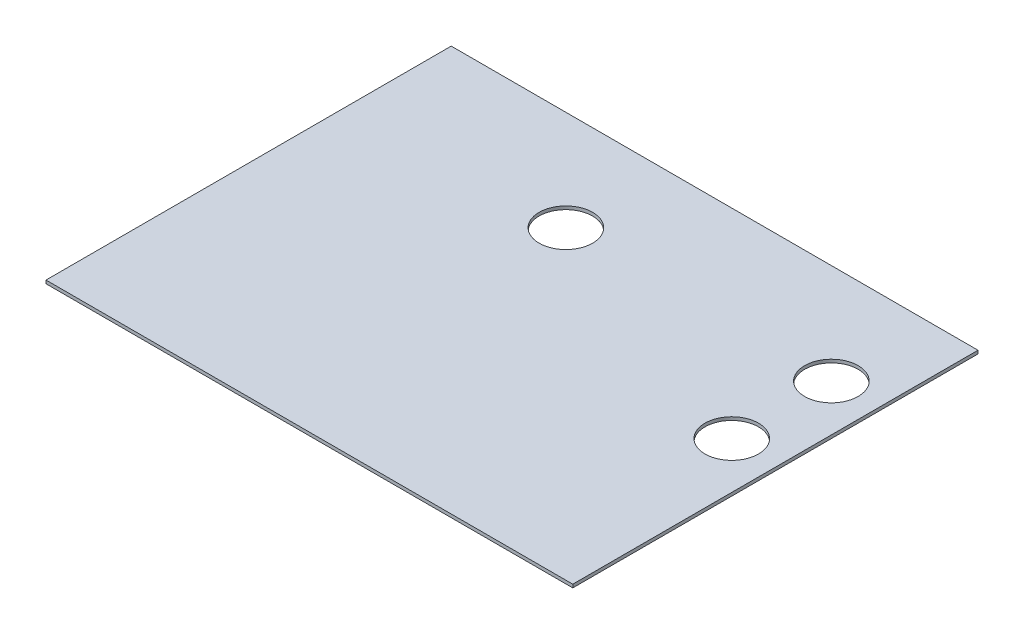
ISO-10303-21;
HEADER;
FILE_DESCRIPTION(('STEP AP214'),'2;1');
FILE_NAME('part.step','',(''),(''),'','','');
FILE_SCHEMA(('AUTOMOTIVE_DESIGN { 1 0 10303 214 1 1 1 1 }'));
ENDSEC;
DATA;
#1=APPLICATION_CONTEXT('core data for automotive mechanical design processes');
#2=APPLICATION_PROTOCOL_DEFINITION('international standard','automotive_design',2000,#1);
#3=PRODUCT_CONTEXT('',#1,'mechanical');
#4=PRODUCT('Part','Part','',(#3));
#5=PRODUCT_RELATED_PRODUCT_CATEGORY('part','',(#4));
#6=PRODUCT_DEFINITION_FORMATION('','',#4);
#7=PRODUCT_DEFINITION_CONTEXT('part definition',#1,'design');
#8=PRODUCT_DEFINITION('design','',#6,#7);
#9=PRODUCT_DEFINITION_SHAPE('','',#8);
#10=(LENGTH_UNIT() NAMED_UNIT(*) SI_UNIT(.MILLI.,.METRE.));
#11=(NAMED_UNIT(*) PLANE_ANGLE_UNIT() SI_UNIT($,.RADIAN.));
#12=(NAMED_UNIT(*) SI_UNIT($,.STERADIAN.) SOLID_ANGLE_UNIT());
#13=UNCERTAINTY_MEASURE_WITH_UNIT(LENGTH_MEASURE(1.E-05),#10,'distance_accuracy_value','');
#14=(GEOMETRIC_REPRESENTATION_CONTEXT(3) GLOBAL_UNCERTAINTY_ASSIGNED_CONTEXT((#13)) GLOBAL_UNIT_ASSIGNED_CONTEXT((#10,
#11,#12)) REPRESENTATION_CONTEXT('',''));
#15=CARTESIAN_POINT('',(0.,0.,0.));
#16=DIRECTION('',(0.,0.,1.));
#17=DIRECTION('',(1.,0.,0.));
#18=AXIS2_PLACEMENT_3D('',#15,#16,#17);
#19=CARTESIAN_POINT('',(162.5,2.,-125.));
#20=DIRECTION('',(-1.,0.,0.));
#21=DIRECTION('',(0.,0.,1.));
#22=AXIS2_PLACEMENT_3D('',#19,#20,#21);
#23=PLANE('',#22);
#24=DIRECTION('',(0.,0.,-1.));
#25=VECTOR('',#24,1.);
#26=CARTESIAN_POINT('',(162.5,0.,-125.));
#27=LINE('',#26,#25);
#28=CARTESIAN_POINT('',(162.5,0.,125.));
#29=VERTEX_POINT('',#28);
#30=CARTESIAN_POINT('',(162.5,0.,-125.));
#31=VERTEX_POINT('',#30);
#32=EDGE_CURVE('E101',#29,#31,#27,.T.);
#33=ORIENTED_EDGE('',*,*,#32,.T.);
#34=DIRECTION('',(0.,-1.,0.));
#35=VECTOR('',#34,1.);
#36=CARTESIAN_POINT('',(162.5,2.,-125.));
#37=LINE('',#36,#35);
#38=CARTESIAN_POINT('',(162.5,2.,-125.));
#39=VERTEX_POINT('',#38);
#40=EDGE_CURVE('E11',#39,#31,#37,.T.);
#41=ORIENTED_EDGE('',*,*,#40,.F.);
#42=DIRECTION('',(0.,0.,-1.));
#43=VECTOR('',#42,1.);
#44=CARTESIAN_POINT('',(162.5,2.,-125.));
#45=LINE('',#44,#43);
#46=CARTESIAN_POINT('',(162.5,2.,125.));
#47=VERTEX_POINT('',#46);
#48=EDGE_CURVE('E89',#47,#39,#45,.T.);
#49=ORIENTED_EDGE('',*,*,#48,.F.);
#50=DIRECTION('',(0.,-1.,0.));
#51=VECTOR('',#50,1.);
#52=CARTESIAN_POINT('',(162.5,2.,125.));
#53=LINE('',#52,#51);
#54=EDGE_CURVE('E97',#47,#29,#53,.T.);
#55=ORIENTED_EDGE('',*,*,#54,.T.);
#56=EDGE_LOOP('',(#33,#41,#49,#55));
#57=FACE_BOUND('',#56,.T.);
#58=ADVANCED_FACE('F38',(#57),#23,.F.);
#59=CARTESIAN_POINT('',(-162.5,2.,-125.));
#60=DIRECTION('',(0.,0.,1.));
#61=DIRECTION('',(1.,0.,0.));
#62=AXIS2_PLACEMENT_3D('',#59,#60,#61);
#63=PLANE('',#62);
#64=DIRECTION('',(-1.,0.,0.));
#65=VECTOR('',#64,1.);
#66=CARTESIAN_POINT('',(-162.5,0.,-125.));
#67=LINE('',#66,#65);
#68=CARTESIAN_POINT('',(-162.5,0.,-125.));
#69=VERTEX_POINT('',#68);
#70=EDGE_CURVE('E93',#31,#69,#67,.T.);
#71=ORIENTED_EDGE('',*,*,#70,.T.);
#72=DIRECTION('',(0.,-1.,0.));
#73=VECTOR('',#72,1.);
#74=CARTESIAN_POINT('',(-162.5,2.,-125.));
#75=LINE('',#74,#73);
#76=CARTESIAN_POINT('',(-162.5,2.,-125.));
#77=VERTEX_POINT('',#76);
#78=EDGE_CURVE('E46',#77,#69,#75,.T.);
#79=ORIENTED_EDGE('',*,*,#78,.F.);
#80=DIRECTION('',(-1.,0.,0.));
#81=VECTOR('',#80,1.);
#82=CARTESIAN_POINT('',(-162.5,2.,-125.));
#83=LINE('',#82,#81);
#84=EDGE_CURVE('E84',#39,#77,#83,.T.);
#85=ORIENTED_EDGE('',*,*,#84,.F.);
#86=ORIENTED_EDGE('',*,*,#40,.T.);
#87=EDGE_LOOP('',(#71,#79,#85,#86));
#88=FACE_BOUND('',#87,.T.);
#89=ADVANCED_FACE('F92',(#88),#63,.F.);
#90=CARTESIAN_POINT('',(-162.5,2.,-125.));
#91=DIRECTION('',(1.,0.,0.));
#92=DIRECTION('',(0.,0.,-1.));
#93=AXIS2_PLACEMENT_3D('',#90,#91,#92);
#94=PLANE('',#93);
#95=DIRECTION('',(0.,0.,1.));
#96=VECTOR('',#95,1.);
#97=CARTESIAN_POINT('',(-162.5,0.,-125.));
#98=LINE('',#97,#96);
#99=CARTESIAN_POINT('',(-162.5,0.,125.));
#100=VERTEX_POINT('',#99);
#101=EDGE_CURVE('E71',#69,#100,#98,.T.);
#102=ORIENTED_EDGE('',*,*,#101,.T.);
#103=DIRECTION('',(0.,-1.,0.));
#104=VECTOR('',#103,1.);
#105=CARTESIAN_POINT('',(-162.5,2.,125.));
#106=LINE('',#105,#104);
#107=CARTESIAN_POINT('',(-162.5,2.,125.));
#108=VERTEX_POINT('',#107);
#109=EDGE_CURVE('E94',#108,#100,#106,.T.);
#110=ORIENTED_EDGE('',*,*,#109,.F.);
#111=DIRECTION('',(0.,0.,1.));
#112=VECTOR('',#111,1.);
#113=CARTESIAN_POINT('',(-162.5,2.,-125.));
#114=LINE('',#113,#112);
#115=EDGE_CURVE('E87',#77,#108,#114,.T.);
#116=ORIENTED_EDGE('',*,*,#115,.F.);
#117=ORIENTED_EDGE('',*,*,#78,.T.);
#118=EDGE_LOOP('',(#102,#110,#116,#117));
#119=FACE_BOUND('',#118,.T.);
#120=ADVANCED_FACE('F95',(#119),#94,.F.);
#121=CARTESIAN_POINT('',(-162.5,2.,125.));
#122=DIRECTION('',(0.,0.,-1.));
#123=DIRECTION('',(-1.,0.,0.));
#124=AXIS2_PLACEMENT_3D('',#121,#122,#123);
#125=PLANE('',#124);
#126=DIRECTION('',(1.,0.,0.));
#127=VECTOR('',#126,1.);
#128=CARTESIAN_POINT('',(-162.5,0.,125.));
#129=LINE('',#128,#127);
#130=EDGE_CURVE('E77',#100,#29,#129,.T.);
#131=ORIENTED_EDGE('',*,*,#130,.T.);
#132=ORIENTED_EDGE('',*,*,#54,.F.);
#133=DIRECTION('',(1.,0.,0.));
#134=VECTOR('',#133,1.);
#135=CARTESIAN_POINT('',(-162.5,2.,125.));
#136=LINE('',#135,#134);
#137=EDGE_CURVE('E54',#108,#47,#136,.T.);
#138=ORIENTED_EDGE('',*,*,#137,.F.);
#139=ORIENTED_EDGE('',*,*,#109,.T.);
#140=EDGE_LOOP('',(#131,#132,#138,#139));
#141=FACE_BOUND('',#140,.T.);
#142=ADVANCED_FACE('F109',(#141),#125,.F.);
#143=CARTESIAN_POINT('',(0.,2.,0.));
#144=DIRECTION('',(0.,1.,0.));
#145=DIRECTION('',(0.,0.,1.));
#146=AXIS2_PLACEMENT_3D('',#143,#144,#145);
#147=PLANE('',#146);
#148=CARTESIAN_POINT('',(133.736379861764,2.,-1.84355757080334));
#149=DIRECTION('',(0.,1.,0.));
#150=DIRECTION('',(0.,0.,1.));
#151=AXIS2_PLACEMENT_3D('',#148,#149,#150);
#152=CIRCLE('',#151,16.5);
#153=CARTESIAN_POINT('',(133.736379861764,2.,14.6564424291967));
#154=VERTEX_POINT('',#153);
#155=EDGE_CURVE('E125',#154,#154,#152,.T.);
#156=ORIENTED_EDGE('',*,*,#155,.F.);
#157=EDGE_LOOP('',(#156));
#158=FACE_BOUND('',#157,.T.);
#159=CARTESIAN_POINT('',(133.736379861764,2.,-63.3119105488594));
#160=DIRECTION('',(0.,1.,0.));
#161=DIRECTION('',(0.,0.,1.));
#162=AXIS2_PLACEMENT_3D('',#159,#160,#161);
#163=CIRCLE('',#162,16.5);
#164=CARTESIAN_POINT('',(133.736379861764,2.,-46.8119105488594));
#165=VERTEX_POINT('',#164);
#166=EDGE_CURVE('E118',#165,#165,#163,.T.);
#167=ORIENTED_EDGE('',*,*,#166,.F.);
#168=EDGE_LOOP('',(#167));
#169=FACE_BOUND('',#168,.T.);
#170=CARTESIAN_POINT('',(-30.0734682991612,2.,-63.3119105488594));
#171=DIRECTION('',(0.,1.,0.));
#172=DIRECTION('',(0.,0.,1.));
#173=AXIS2_PLACEMENT_3D('',#170,#171,#172);
#174=CIRCLE('',#173,16.5);
#175=CARTESIAN_POINT('',(-30.0734682991612,2.,-46.8119105488594));
#176=VERTEX_POINT('',#175);
#177=EDGE_CURVE('E119',#176,#176,#174,.T.);
#178=ORIENTED_EDGE('',*,*,#177,.F.);
#179=EDGE_LOOP('',(#178));
#180=FACE_BOUND('',#179,.T.);
#181=ORIENTED_EDGE('',*,*,#48,.T.);
#182=ORIENTED_EDGE('',*,*,#84,.T.);
#183=ORIENTED_EDGE('',*,*,#115,.T.);
#184=ORIENTED_EDGE('',*,*,#137,.T.);
#185=EDGE_LOOP('',(#181,#182,#183,#184));
#186=FACE_BOUND('',#185,.T.);
#187=ADVANCED_FACE('F85',(#158,#169,#180,#186),#147,.T.);
#188=CARTESIAN_POINT('',(0.,0.,0.));
#189=DIRECTION('',(0.,1.,0.));
#190=DIRECTION('',(0.,0.,1.));
#191=AXIS2_PLACEMENT_3D('',#188,#189,#190);
#192=PLANE('',#191);
#193=CARTESIAN_POINT('',(133.736379861764,0.,-1.84355757080334));
#194=DIRECTION('',(0.,1.,0.));
#195=DIRECTION('',(0.,0.,1.));
#196=AXIS2_PLACEMENT_3D('',#193,#194,#195);
#197=CIRCLE('',#196,16.5);
#198=CARTESIAN_POINT('',(133.736379861764,0.,14.6564424291967));
#199=VERTEX_POINT('',#198);
#200=EDGE_CURVE('E104',#199,#199,#197,.F.);
#201=ORIENTED_EDGE('',*,*,#200,.F.);
#202=EDGE_LOOP('',(#201));
#203=FACE_BOUND('',#202,.T.);
#204=CARTESIAN_POINT('',(133.736379861764,0.,-63.3119105488594));
#205=DIRECTION('',(0.,1.,0.));
#206=DIRECTION('',(0.,0.,1.));
#207=AXIS2_PLACEMENT_3D('',#204,#205,#206);
#208=CIRCLE('',#207,16.5);
#209=CARTESIAN_POINT('',(133.736379861764,0.,-46.8119105488594));
#210=VERTEX_POINT('',#209);
#211=EDGE_CURVE('E122',#210,#210,#208,.F.);
#212=ORIENTED_EDGE('',*,*,#211,.F.);
#213=EDGE_LOOP('',(#212));
#214=FACE_BOUND('',#213,.T.);
#215=CARTESIAN_POINT('',(-30.0734682991612,0.,-63.3119105488594));
#216=DIRECTION('',(0.,1.,0.));
#217=DIRECTION('',(0.,0.,1.));
#218=AXIS2_PLACEMENT_3D('',#215,#216,#217);
#219=CIRCLE('',#218,16.5);
#220=CARTESIAN_POINT('',(-30.0734682991612,0.,-46.8119105488594));
#221=VERTEX_POINT('',#220);
#222=EDGE_CURVE('E115',#221,#221,#219,.F.);
#223=ORIENTED_EDGE('',*,*,#222,.F.);
#224=EDGE_LOOP('',(#223));
#225=FACE_BOUND('',#224,.T.);
#226=ORIENTED_EDGE('',*,*,#32,.F.);
#227=ORIENTED_EDGE('',*,*,#130,.F.);
#228=ORIENTED_EDGE('',*,*,#101,.F.);
#229=ORIENTED_EDGE('',*,*,#70,.F.);
#230=EDGE_LOOP('',(#226,#227,#228,#229));
#231=FACE_BOUND('',#230,.T.);
#232=ADVANCED_FACE('F112',(#203,#214,#225,#231),#192,.F.);
#233=CARTESIAN_POINT('',(-30.0734682991612,-0.00100000000000013,-63.3119105488594));
#234=DIRECTION('',(0.,1.,0.));
#235=DIRECTION('',(0.,0.,1.));
#236=AXIS2_PLACEMENT_3D('',#233,#234,#235);
#237=CYLINDRICAL_SURFACE('',#236,16.5);
#238=ORIENTED_EDGE('',*,*,#177,.T.);
#239=EDGE_LOOP('',(#238));
#240=FACE_BOUND('',#239,.T.);
#241=ORIENTED_EDGE('',*,*,#222,.T.);
#242=EDGE_LOOP('',(#241));
#243=FACE_BOUND('',#242,.T.);
#244=ADVANCED_FACE('F143',(#240,#243),#237,.F.);
#245=CARTESIAN_POINT('',(133.736379861764,-0.00100000000000013,-63.3119105488594));
#246=DIRECTION('',(0.,1.,0.));
#247=DIRECTION('',(0.,0.,1.));
#248=AXIS2_PLACEMENT_3D('',#245,#246,#247);
#249=CYLINDRICAL_SURFACE('',#248,16.5);
#250=ORIENTED_EDGE('',*,*,#166,.T.);
#251=EDGE_LOOP('',(#250));
#252=FACE_BOUND('',#251,.T.);
#253=ORIENTED_EDGE('',*,*,#211,.T.);
#254=EDGE_LOOP('',(#253));
#255=FACE_BOUND('',#254,.T.);
#256=ADVANCED_FACE('F146',(#252,#255),#249,.F.);
#257=CARTESIAN_POINT('',(133.736379861764,-0.00100000000000013,-1.84355757080334));
#258=DIRECTION('',(0.,1.,0.));
#259=DIRECTION('',(0.,0.,1.));
#260=AXIS2_PLACEMENT_3D('',#257,#258,#259);
#261=CYLINDRICAL_SURFACE('',#260,16.5);
#262=ORIENTED_EDGE('',*,*,#155,.T.);
#263=EDGE_LOOP('',(#262));
#264=FACE_BOUND('',#263,.T.);
#265=ORIENTED_EDGE('',*,*,#200,.T.);
#266=EDGE_LOOP('',(#265));
#267=FACE_BOUND('',#266,.T.);
#268=ADVANCED_FACE('F133',(#264,#267),#261,.F.);
#269=CLOSED_SHELL('',(#58,#89,#120,#142,#187,#232,#244,#256,#268));
#270=MANIFOLD_SOLID_BREP('B2',#269);
#271=ADVANCED_BREP_SHAPE_REPRESENTATION('',(#18,#270),#14);
#272=SHAPE_DEFINITION_REPRESENTATION(#9,#271);
ENDSEC;
END-ISO-10303-21;
